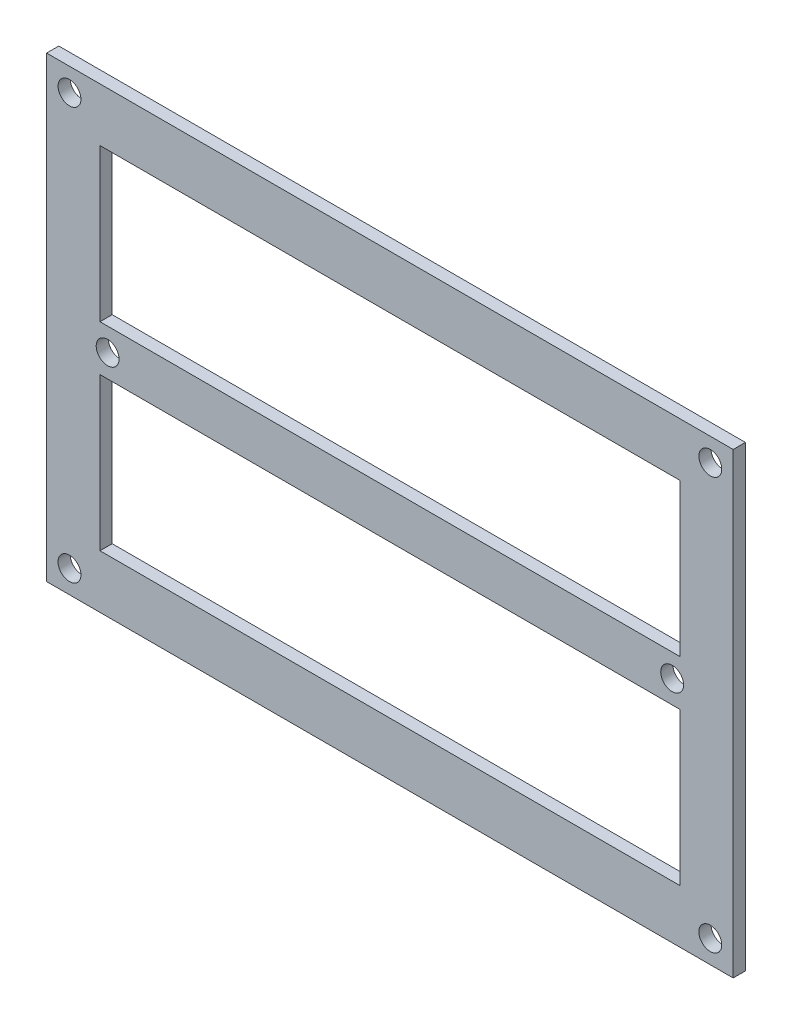
ISO-10303-21;
HEADER;
FILE_DESCRIPTION(('STEP AP214'),'2;1');
FILE_NAME('part.step','',(''),(''),'','','');
FILE_SCHEMA(('AUTOMOTIVE_DESIGN { 1 0 10303 214 1 1 1 1 }'));
ENDSEC;
DATA;
#1=APPLICATION_CONTEXT('core data for automotive mechanical design processes');
#2=APPLICATION_PROTOCOL_DEFINITION('international standard','automotive_design',2000,#1);
#3=PRODUCT_CONTEXT('',#1,'mechanical');
#4=PRODUCT('Part','Part','',(#3));
#5=PRODUCT_RELATED_PRODUCT_CATEGORY('part','',(#4));
#6=PRODUCT_DEFINITION_FORMATION('','',#4);
#7=PRODUCT_DEFINITION_CONTEXT('part definition',#1,'design');
#8=PRODUCT_DEFINITION('design','',#6,#7);
#9=PRODUCT_DEFINITION_SHAPE('','',#8);
#10=(LENGTH_UNIT() NAMED_UNIT(*) SI_UNIT(.MILLI.,.METRE.));
#11=(NAMED_UNIT(*) PLANE_ANGLE_UNIT() SI_UNIT($,.RADIAN.));
#12=(NAMED_UNIT(*) SI_UNIT($,.STERADIAN.) SOLID_ANGLE_UNIT());
#13=UNCERTAINTY_MEASURE_WITH_UNIT(LENGTH_MEASURE(1.E-05),#10,'distance_accuracy_value','');
#14=(GEOMETRIC_REPRESENTATION_CONTEXT(3) GLOBAL_UNCERTAINTY_ASSIGNED_CONTEXT((#13)) GLOBAL_UNIT_ASSIGNED_CONTEXT((#10,
#11,#12)) REPRESENTATION_CONTEXT('',''));
#15=CARTESIAN_POINT('',(0.,0.,0.));
#16=DIRECTION('',(0.,0.,1.));
#17=DIRECTION('',(1.,0.,0.));
#18=AXIS2_PLACEMENT_3D('',#15,#16,#17);
#19=CARTESIAN_POINT('',(-55.1929824561404,27.3684210526316,1.6));
#20=DIRECTION('',(1.,0.,0.));
#21=DIRECTION('',(0.,1.,0.));
#22=AXIS2_PLACEMENT_3D('',#19,#20,#21);
#23=PLANE('',#22);
#24=DIRECTION('',(0.,-1.,0.));
#25=VECTOR('',#24,1.);
#26=CARTESIAN_POINT('',(-55.1929824561404,27.3684210526316,0.));
#27=LINE('',#26,#25);
#28=CARTESIAN_POINT('',(-55.1929824561404,27.3684210526316,0.));
#29=VERTEX_POINT('',#28);
#30=CARTESIAN_POINT('',(-55.1929824561403,-32.6315789473684,0.));
#31=VERTEX_POINT('',#30);
#32=EDGE_CURVE('E195',#29,#31,#27,.T.);
#33=ORIENTED_EDGE('',*,*,#32,.T.);
#34=DIRECTION('',(0.,0.,-1.));
#35=VECTOR('',#34,1.);
#36=CARTESIAN_POINT('',(-55.1929824561403,-32.6315789473684,1.6));
#37=LINE('',#36,#35);
#38=CARTESIAN_POINT('',(-55.1929824561403,-32.6315789473684,1.6));
#39=VERTEX_POINT('',#38);
#40=EDGE_CURVE('E11',#39,#31,#37,.T.);
#41=ORIENTED_EDGE('',*,*,#40,.F.);
#42=DIRECTION('',(0.,-1.,0.));
#43=VECTOR('',#42,1.);
#44=CARTESIAN_POINT('',(-55.1929824561404,27.3684210526316,1.6));
#45=LINE('',#44,#43);
#46=CARTESIAN_POINT('',(-55.1929824561404,27.3684210526316,1.6));
#47=VERTEX_POINT('',#46);
#48=EDGE_CURVE('E202',#47,#39,#45,.T.);
#49=ORIENTED_EDGE('',*,*,#48,.F.);
#50=DIRECTION('',(0.,0.,-1.));
#51=VECTOR('',#50,1.);
#52=CARTESIAN_POINT('',(-55.1929824561404,27.3684210526316,1.6));
#53=LINE('',#52,#51);
#54=EDGE_CURVE('E212',#47,#29,#53,.T.);
#55=ORIENTED_EDGE('',*,*,#54,.T.);
#56=EDGE_LOOP('',(#33,#41,#49,#55));
#57=FACE_BOUND('',#56,.T.);
#58=ADVANCED_FACE('F33',(#57),#23,.F.);
#59=CARTESIAN_POINT('',(-55.1929824561403,-32.6315789473684,1.6));
#60=DIRECTION('',(0.,1.,0.));
#61=DIRECTION('',(0.,0.,1.));
#62=AXIS2_PLACEMENT_3D('',#59,#60,#61);
#63=PLANE('',#62);
#64=DIRECTION('',(1.,0.,0.));
#65=VECTOR('',#64,1.);
#66=CARTESIAN_POINT('',(-55.1929824561403,-32.6315789473684,0.));
#67=LINE('',#66,#65);
#68=CARTESIAN_POINT('',(34.8070175438596,-32.6315789473684,0.));
#69=VERTEX_POINT('',#68);
#70=EDGE_CURVE('E215',#31,#69,#67,.T.);
#71=ORIENTED_EDGE('',*,*,#70,.T.);
#72=DIRECTION('',(0.,0.,-1.));
#73=VECTOR('',#72,1.);
#74=CARTESIAN_POINT('',(34.8070175438596,-32.6315789473684,1.6));
#75=LINE('',#74,#73);
#76=CARTESIAN_POINT('',(34.8070175438596,-32.6315789473684,1.6));
#77=VERTEX_POINT('',#76);
#78=EDGE_CURVE('E40',#77,#69,#75,.T.);
#79=ORIENTED_EDGE('',*,*,#78,.F.);
#80=DIRECTION('',(1.,0.,0.));
#81=VECTOR('',#80,1.);
#82=CARTESIAN_POINT('',(-55.1929824561403,-32.6315789473684,1.6));
#83=LINE('',#82,#81);
#84=EDGE_CURVE('E205',#39,#77,#83,.T.);
#85=ORIENTED_EDGE('',*,*,#84,.F.);
#86=ORIENTED_EDGE('',*,*,#40,.T.);
#87=EDGE_LOOP('',(#71,#79,#85,#86));
#88=FACE_BOUND('',#87,.T.);
#89=ADVANCED_FACE('F244',(#88),#63,.F.);
#90=CARTESIAN_POINT('',(34.8070175438596,27.3684210526316,1.6));
#91=DIRECTION('',(-1.,0.,0.));
#92=DIRECTION('',(0.,0.,1.));
#93=AXIS2_PLACEMENT_3D('',#90,#91,#92);
#94=PLANE('',#93);
#95=DIRECTION('',(0.,1.,0.));
#96=VECTOR('',#95,1.);
#97=CARTESIAN_POINT('',(34.8070175438596,27.3684210526316,0.));
#98=LINE('',#97,#96);
#99=CARTESIAN_POINT('',(34.8070175438596,27.3684210526316,0.));
#100=VERTEX_POINT('',#99);
#101=EDGE_CURVE('E217',#69,#100,#98,.T.);
#102=ORIENTED_EDGE('',*,*,#101,.T.);
#103=DIRECTION('',(0.,0.,-1.));
#104=VECTOR('',#103,1.);
#105=CARTESIAN_POINT('',(34.8070175438596,27.3684210526316,1.6));
#106=LINE('',#105,#104);
#107=CARTESIAN_POINT('',(34.8070175438596,27.3684210526316,1.6));
#108=VERTEX_POINT('',#107);
#109=EDGE_CURVE('E222',#108,#100,#106,.T.);
#110=ORIENTED_EDGE('',*,*,#109,.F.);
#111=DIRECTION('',(0.,1.,0.));
#112=VECTOR('',#111,1.);
#113=CARTESIAN_POINT('',(34.8070175438596,27.3684210526316,1.6));
#114=LINE('',#113,#112);
#115=EDGE_CURVE('E208',#77,#108,#114,.T.);
#116=ORIENTED_EDGE('',*,*,#115,.F.);
#117=ORIENTED_EDGE('',*,*,#78,.T.);
#118=EDGE_LOOP('',(#102,#110,#116,#117));
#119=FACE_BOUND('',#118,.T.);
#120=ADVANCED_FACE('F229',(#119),#94,.F.);
#121=CARTESIAN_POINT('',(-55.1929824561404,27.3684210526316,1.6));
#122=DIRECTION('',(0.,-1.,0.));
#123=DIRECTION('',(0.,0.,-1.));
#124=AXIS2_PLACEMENT_3D('',#121,#122,#123);
#125=PLANE('',#124);
#126=DIRECTION('',(-1.,0.,0.));
#127=VECTOR('',#126,1.);
#128=CARTESIAN_POINT('',(-55.1929824561404,27.3684210526316,0.));
#129=LINE('',#128,#127);
#130=EDGE_CURVE('E206',#100,#29,#129,.T.);
#131=ORIENTED_EDGE('',*,*,#130,.T.);
#132=ORIENTED_EDGE('',*,*,#54,.F.);
#133=DIRECTION('',(-1.,0.,0.));
#134=VECTOR('',#133,1.);
#135=CARTESIAN_POINT('',(-55.1929824561404,27.3684210526316,1.6));
#136=LINE('',#135,#134);
#137=EDGE_CURVE('E210',#108,#47,#136,.T.);
#138=ORIENTED_EDGE('',*,*,#137,.F.);
#139=ORIENTED_EDGE('',*,*,#109,.T.);
#140=EDGE_LOOP('',(#131,#132,#138,#139));
#141=FACE_BOUND('',#140,.T.);
#142=ADVANCED_FACE('F238',(#141),#125,.F.);
#143=CARTESIAN_POINT('',(0.,0.,1.6));
#144=DIRECTION('',(0.,0.,1.));
#145=DIRECTION('',(1.,0.,0.));
#146=AXIS2_PLACEMENT_3D('',#143,#144,#145);
#147=PLANE('',#146);
#148=CARTESIAN_POINT('',(-52.1929824561404,24.3684210526316,1.6));
#149=DIRECTION('',(0.,0.,-1.));
#150=DIRECTION('',(-1.,0.,0.));
#151=AXIS2_PLACEMENT_3D('',#148,#149,#150);
#152=CIRCLE('',#151,1.5);
#153=CARTESIAN_POINT('',(-53.6929824561404,24.3684210526316,1.6));
#154=VERTEX_POINT('',#153);
#155=EDGE_CURVE('E338',#154,#154,#152,.T.);
#156=ORIENTED_EDGE('',*,*,#155,.T.);
#157=EDGE_LOOP('',(#156));
#158=FACE_BOUND('',#157,.T.);
#159=CARTESIAN_POINT('',(26.8070175438596,-2.63157894736842,1.6));
#160=DIRECTION('',(0.,0.,-1.));
#161=DIRECTION('',(-1.,0.,0.));
#162=AXIS2_PLACEMENT_3D('',#159,#160,#161);
#163=CIRCLE('',#162,1.5);
#164=CARTESIAN_POINT('',(25.3070175438596,-2.63157894736842,1.6));
#165=VERTEX_POINT('',#164);
#166=EDGE_CURVE('E171',#165,#165,#163,.T.);
#167=ORIENTED_EDGE('',*,*,#166,.T.);
#168=EDGE_LOOP('',(#167));
#169=FACE_BOUND('',#168,.T.);
#170=CARTESIAN_POINT('',(-47.1929824561404,-2.63157894736842,1.6));
#171=DIRECTION('',(0.,0.,-1.));
#172=DIRECTION('',(-1.,0.,0.));
#173=AXIS2_PLACEMENT_3D('',#170,#171,#172);
#174=CIRCLE('',#173,1.5);
#175=CARTESIAN_POINT('',(-48.6929824561404,-2.63157894736842,1.6));
#176=VERTEX_POINT('',#175);
#177=EDGE_CURVE('E156',#176,#176,#174,.T.);
#178=ORIENTED_EDGE('',*,*,#177,.T.);
#179=EDGE_LOOP('',(#178));
#180=FACE_BOUND('',#179,.T.);
#181=DIRECTION('',(0.,-1.,0.));
#182=VECTOR('',#181,1.);
#183=CARTESIAN_POINT('',(27.8070175438596,-5.63157894736842,1.6));
#184=LINE('',#183,#182);
#185=CARTESIAN_POINT('',(27.8070175438596,-5.63157894736842,1.6));
#186=VERTEX_POINT('',#185);
#187=CARTESIAN_POINT('',(27.8070175438596,-25.6315789473684,1.6));
#188=VERTEX_POINT('',#187);
#189=EDGE_CURVE('E125',#186,#188,#184,.T.);
#190=ORIENTED_EDGE('',*,*,#189,.T.);
#191=DIRECTION('',(-1.,0.,0.));
#192=VECTOR('',#191,1.);
#193=CARTESIAN_POINT('',(27.8070175438596,-25.6315789473684,1.6));
#194=LINE('',#193,#192);
#195=CARTESIAN_POINT('',(-48.1929824561404,-25.6315789473684,1.6));
#196=VERTEX_POINT('',#195);
#197=EDGE_CURVE('E136',#188,#196,#194,.T.);
#198=ORIENTED_EDGE('',*,*,#197,.T.);
#199=DIRECTION('',(0.,1.,0.));
#200=VECTOR('',#199,1.);
#201=CARTESIAN_POINT('',(-48.1929824561404,-5.63157894736842,1.6));
#202=LINE('',#201,#200);
#203=CARTESIAN_POINT('',(-48.1929824561404,-5.63157894736842,1.6));
#204=VERTEX_POINT('',#203);
#205=EDGE_CURVE('E47',#196,#204,#202,.T.);
#206=ORIENTED_EDGE('',*,*,#205,.T.);
#207=DIRECTION('',(1.,0.,0.));
#208=VECTOR('',#207,1.);
#209=CARTESIAN_POINT('',(27.8070175438596,-5.63157894736842,1.6));
#210=LINE('',#209,#208);
#211=EDGE_CURVE('E133',#204,#186,#210,.T.);
#212=ORIENTED_EDGE('',*,*,#211,.T.);
#213=EDGE_LOOP('',(#190,#198,#206,#212));
#214=FACE_BOUND('',#213,.T.);
#215=CARTESIAN_POINT('',(31.8070175438591,-29.631578947369,1.6));
#216=DIRECTION('',(0.,0.,-1.));
#217=DIRECTION('',(-1.,0.,0.));
#218=AXIS2_PLACEMENT_3D('',#215,#216,#217);
#219=CIRCLE('',#218,1.5);
#220=CARTESIAN_POINT('',(30.3070175438591,-29.631578947369,1.6));
#221=VERTEX_POINT('',#220);
#222=EDGE_CURVE('E314',#221,#221,#219,.T.);
#223=ORIENTED_EDGE('',*,*,#222,.T.);
#224=EDGE_LOOP('',(#223));
#225=FACE_BOUND('',#224,.T.);
#226=CARTESIAN_POINT('',(-52.1929824561409,-29.6315789473684,1.6));
#227=DIRECTION('',(0.,0.,-1.));
#228=DIRECTION('',(-1.,0.,0.));
#229=AXIS2_PLACEMENT_3D('',#226,#227,#228);
#230=CIRCLE('',#229,1.5);
#231=CARTESIAN_POINT('',(-53.6929824561409,-29.6315789473684,1.6));
#232=VERTEX_POINT('',#231);
#233=EDGE_CURVE('E329',#232,#232,#230,.T.);
#234=ORIENTED_EDGE('',*,*,#233,.T.);
#235=EDGE_LOOP('',(#234));
#236=FACE_BOUND('',#235,.T.);
#237=CARTESIAN_POINT('',(31.8070175438597,24.368421052631,1.6));
#238=DIRECTION('',(0.,0.,-1.));
#239=DIRECTION('',(-1.,0.,0.));
#240=AXIS2_PLACEMENT_3D('',#237,#238,#239);
#241=CIRCLE('',#240,1.5);
#242=CARTESIAN_POINT('',(30.3070175438596,24.368421052631,1.6));
#243=VERTEX_POINT('',#242);
#244=EDGE_CURVE('E323',#243,#243,#241,.T.);
#245=ORIENTED_EDGE('',*,*,#244,.T.);
#246=EDGE_LOOP('',(#245));
#247=FACE_BOUND('',#246,.T.);
#248=DIRECTION('',(0.,-1.,0.));
#249=VECTOR('',#248,1.);
#250=CARTESIAN_POINT('',(27.8070175438596,20.3684210526316,1.6));
#251=LINE('',#250,#249);
#252=CARTESIAN_POINT('',(27.8070175438596,20.3684210526316,1.6));
#253=VERTEX_POINT('',#252);
#254=CARTESIAN_POINT('',(27.8070175438596,0.368421052631577,1.6));
#255=VERTEX_POINT('',#254);
#256=EDGE_CURVE('E172',#253,#255,#251,.T.);
#257=ORIENTED_EDGE('',*,*,#256,.T.);
#258=DIRECTION('',(-1.,0.,0.));
#259=VECTOR('',#258,1.);
#260=CARTESIAN_POINT('',(27.8070175438596,0.368421052631577,1.6));
#261=LINE('',#260,#259);
#262=CARTESIAN_POINT('',(-48.1929824561404,0.368421052631577,1.6));
#263=VERTEX_POINT('',#262);
#264=EDGE_CURVE('E175',#255,#263,#261,.T.);
#265=ORIENTED_EDGE('',*,*,#264,.T.);
#266=DIRECTION('',(0.,1.,0.));
#267=VECTOR('',#266,1.);
#268=CARTESIAN_POINT('',(-48.1929824561403,20.3684210526316,1.6));
#269=LINE('',#268,#267);
#270=CARTESIAN_POINT('',(-48.1929824561403,20.3684210526316,1.6));
#271=VERTEX_POINT('',#270);
#272=EDGE_CURVE('E55',#263,#271,#269,.T.);
#273=ORIENTED_EDGE('',*,*,#272,.T.);
#274=DIRECTION('',(1.,0.,0.));
#275=VECTOR('',#274,1.);
#276=CARTESIAN_POINT('',(27.8070175438596,20.3684210526316,1.6));
#277=LINE('',#276,#275);
#278=EDGE_CURVE('E180',#271,#253,#277,.T.);
#279=ORIENTED_EDGE('',*,*,#278,.T.);
#280=EDGE_LOOP('',(#257,#265,#273,#279));
#281=FACE_BOUND('',#280,.T.);
#282=ORIENTED_EDGE('',*,*,#48,.T.);
#283=ORIENTED_EDGE('',*,*,#84,.T.);
#284=ORIENTED_EDGE('',*,*,#115,.T.);
#285=ORIENTED_EDGE('',*,*,#137,.T.);
#286=EDGE_LOOP('',(#282,#283,#284,#285));
#287=FACE_BOUND('',#286,.T.);
#288=ADVANCED_FACE('F140',(#158,#169,#180,#214,#225,#236,#247,#281,#287),#147,.T.);
#289=CARTESIAN_POINT('',(0.,0.,0.));
#290=DIRECTION('',(0.,0.,1.));
#291=DIRECTION('',(1.,0.,0.));
#292=AXIS2_PLACEMENT_3D('',#289,#290,#291);
#293=PLANE('',#292);
#294=CARTESIAN_POINT('',(-52.1929824561404,24.3684210526316,0.));
#295=DIRECTION('',(0.,0.,-1.));
#296=DIRECTION('',(-1.,0.,0.));
#297=AXIS2_PLACEMENT_3D('',#294,#295,#296);
#298=CIRCLE('',#297,1.5);
#299=CARTESIAN_POINT('',(-53.6929824561404,24.3684210526316,0.));
#300=VERTEX_POINT('',#299);
#301=EDGE_CURVE('E149',#300,#300,#298,.T.);
#302=ORIENTED_EDGE('',*,*,#301,.F.);
#303=EDGE_LOOP('',(#302));
#304=FACE_BOUND('',#303,.T.);
#305=CARTESIAN_POINT('',(26.8070175438596,-2.63157894736842,0.));
#306=DIRECTION('',(0.,0.,-1.));
#307=DIRECTION('',(-1.,0.,0.));
#308=AXIS2_PLACEMENT_3D('',#305,#306,#307);
#309=CIRCLE('',#308,1.5);
#310=CARTESIAN_POINT('',(25.3070175438596,-2.63157894736842,0.));
#311=VERTEX_POINT('',#310);
#312=EDGE_CURVE('E336',#311,#311,#309,.T.);
#313=ORIENTED_EDGE('',*,*,#312,.F.);
#314=EDGE_LOOP('',(#313));
#315=FACE_BOUND('',#314,.T.);
#316=CARTESIAN_POINT('',(-47.1929824561404,-2.63157894736842,0.));
#317=DIRECTION('',(0.,0.,-1.));
#318=DIRECTION('',(-1.,0.,0.));
#319=AXIS2_PLACEMENT_3D('',#316,#317,#318);
#320=CIRCLE('',#319,1.5);
#321=CARTESIAN_POINT('',(-48.6929824561404,-2.63157894736842,0.));
#322=VERTEX_POINT('',#321);
#323=EDGE_CURVE('E168',#322,#322,#320,.T.);
#324=ORIENTED_EDGE('',*,*,#323,.F.);
#325=EDGE_LOOP('',(#324));
#326=FACE_BOUND('',#325,.T.);
#327=DIRECTION('',(-1.,0.,0.));
#328=VECTOR('',#327,1.);
#329=CARTESIAN_POINT('',(27.8070175438596,-25.6315789473684,0.));
#330=LINE('',#329,#328);
#331=CARTESIAN_POINT('',(27.8070175438596,-25.6315789473684,0.));
#332=VERTEX_POINT('',#331);
#333=CARTESIAN_POINT('',(-48.1929824561404,-25.6315789473684,0.));
#334=VERTEX_POINT('',#333);
#335=EDGE_CURVE('E155',#332,#334,#330,.T.);
#336=ORIENTED_EDGE('',*,*,#335,.F.);
#337=DIRECTION('',(0.,-1.,0.));
#338=VECTOR('',#337,1.);
#339=CARTESIAN_POINT('',(27.8070175438596,-5.63157894736842,0.));
#340=LINE('',#339,#338);
#341=CARTESIAN_POINT('',(27.8070175438596,-5.63157894736842,0.));
#342=VERTEX_POINT('',#341);
#343=EDGE_CURVE('E128',#342,#332,#340,.T.);
#344=ORIENTED_EDGE('',*,*,#343,.F.);
#345=DIRECTION('',(1.,0.,0.));
#346=VECTOR('',#345,1.);
#347=CARTESIAN_POINT('',(27.8070175438596,-5.63157894736842,0.));
#348=LINE('',#347,#346);
#349=CARTESIAN_POINT('',(-48.1929824561404,-5.63157894736842,0.));
#350=VERTEX_POINT('',#349);
#351=EDGE_CURVE('E143',#350,#342,#348,.T.);
#352=ORIENTED_EDGE('',*,*,#351,.F.);
#353=DIRECTION('',(0.,1.,0.));
#354=VECTOR('',#353,1.);
#355=CARTESIAN_POINT('',(-48.1929824561404,-5.63157894736842,0.));
#356=LINE('',#355,#354);
#357=EDGE_CURVE('E146',#334,#350,#356,.T.);
#358=ORIENTED_EDGE('',*,*,#357,.F.);
#359=EDGE_LOOP('',(#336,#344,#352,#358));
#360=FACE_BOUND('',#359,.T.);
#361=CARTESIAN_POINT('',(31.8070175438591,-29.631578947369,0.));
#362=DIRECTION('',(0.,0.,-1.));
#363=DIRECTION('',(-1.,0.,0.));
#364=AXIS2_PLACEMENT_3D('',#361,#362,#363);
#365=CIRCLE('',#364,1.5);
#366=CARTESIAN_POINT('',(30.3070175438591,-29.631578947369,0.));
#367=VERTEX_POINT('',#366);
#368=EDGE_CURVE('E317',#367,#367,#365,.T.);
#369=ORIENTED_EDGE('',*,*,#368,.F.);
#370=EDGE_LOOP('',(#369));
#371=FACE_BOUND('',#370,.T.);
#372=CARTESIAN_POINT('',(-52.1929824561409,-29.6315789473684,0.));
#373=DIRECTION('',(0.,0.,-1.));
#374=DIRECTION('',(-1.,0.,0.));
#375=AXIS2_PLACEMENT_3D('',#372,#373,#374);
#376=CIRCLE('',#375,1.5);
#377=CARTESIAN_POINT('',(-53.6929824561409,-29.6315789473684,0.));
#378=VERTEX_POINT('',#377);
#379=EDGE_CURVE('E320',#378,#378,#376,.T.);
#380=ORIENTED_EDGE('',*,*,#379,.F.);
#381=EDGE_LOOP('',(#380));
#382=FACE_BOUND('',#381,.T.);
#383=CARTESIAN_POINT('',(31.8070175438597,24.368421052631,0.));
#384=DIRECTION('',(0.,0.,-1.));
#385=DIRECTION('',(-1.,0.,0.));
#386=AXIS2_PLACEMENT_3D('',#383,#384,#385);
#387=CIRCLE('',#386,1.5);
#388=CARTESIAN_POINT('',(30.3070175438596,24.368421052631,0.));
#389=VERTEX_POINT('',#388);
#390=EDGE_CURVE('E326',#389,#389,#387,.T.);
#391=ORIENTED_EDGE('',*,*,#390,.F.);
#392=EDGE_LOOP('',(#391));
#393=FACE_BOUND('',#392,.T.);
#394=DIRECTION('',(-1.,0.,0.));
#395=VECTOR('',#394,1.);
#396=CARTESIAN_POINT('',(27.8070175438596,0.368421052631577,0.));
#397=LINE('',#396,#395);
#398=CARTESIAN_POINT('',(27.8070175438596,0.368421052631577,0.));
#399=VERTEX_POINT('',#398);
#400=CARTESIAN_POINT('',(-48.1929824561404,0.368421052631577,0.));
#401=VERTEX_POINT('',#400);
#402=EDGE_CURVE('E185',#399,#401,#397,.T.);
#403=ORIENTED_EDGE('',*,*,#402,.F.);
#404=DIRECTION('',(0.,-1.,0.));
#405=VECTOR('',#404,1.);
#406=CARTESIAN_POINT('',(27.8070175438596,20.3684210526316,0.));
#407=LINE('',#406,#405);
#408=CARTESIAN_POINT('',(27.8070175438596,20.3684210526316,0.));
#409=VERTEX_POINT('',#408);
#410=EDGE_CURVE('E162',#409,#399,#407,.T.);
#411=ORIENTED_EDGE('',*,*,#410,.F.);
#412=DIRECTION('',(1.,0.,0.));
#413=VECTOR('',#412,1.);
#414=CARTESIAN_POINT('',(27.8070175438596,20.3684210526316,0.));
#415=LINE('',#414,#413);
#416=CARTESIAN_POINT('',(-48.1929824561403,20.3684210526316,0.));
#417=VERTEX_POINT('',#416);
#418=EDGE_CURVE('E176',#417,#409,#415,.T.);
#419=ORIENTED_EDGE('',*,*,#418,.F.);
#420=DIRECTION('',(0.,1.,0.));
#421=VECTOR('',#420,1.);
#422=CARTESIAN_POINT('',(-48.1929824561403,20.3684210526316,0.));
#423=LINE('',#422,#421);
#424=EDGE_CURVE('E188',#401,#417,#423,.T.);
#425=ORIENTED_EDGE('',*,*,#424,.F.);
#426=EDGE_LOOP('',(#403,#411,#419,#425));
#427=FACE_BOUND('',#426,.T.);
#428=ORIENTED_EDGE('',*,*,#32,.F.);
#429=ORIENTED_EDGE('',*,*,#130,.F.);
#430=ORIENTED_EDGE('',*,*,#101,.F.);
#431=ORIENTED_EDGE('',*,*,#70,.F.);
#432=EDGE_LOOP('',(#428,#429,#430,#431));
#433=FACE_BOUND('',#432,.T.);
#434=ADVANCED_FACE('F235',(#304,#315,#326,#360,#371,#382,#393,#427,#433),#293,.F.);
#435=CARTESIAN_POINT('',(27.8070175438596,20.3684210526316,1.6));
#436=DIRECTION('',(1.,0.,0.));
#437=DIRECTION('',(0.,1.,0.));
#438=AXIS2_PLACEMENT_3D('',#435,#436,#437);
#439=PLANE('',#438);
#440=ORIENTED_EDGE('',*,*,#410,.T.);
#441=DIRECTION('',(0.,0.,-1.));
#442=VECTOR('',#441,1.);
#443=CARTESIAN_POINT('',(27.8070175438596,0.368421052631577,1.6));
#444=LINE('',#443,#442);
#445=EDGE_CURVE('E183',#255,#399,#444,.T.);
#446=ORIENTED_EDGE('',*,*,#445,.F.);
#447=ORIENTED_EDGE('',*,*,#256,.F.);
#448=DIRECTION('',(0.,0.,-1.));
#449=VECTOR('',#448,1.);
#450=CARTESIAN_POINT('',(27.8070175438596,20.3684210526316,1.6));
#451=LINE('',#450,#449);
#452=EDGE_CURVE('E193',#253,#409,#451,.T.);
#453=ORIENTED_EDGE('',*,*,#452,.T.);
#454=EDGE_LOOP('',(#440,#446,#447,#453));
#455=FACE_BOUND('',#454,.T.);
#456=ADVANCED_FACE('F256',(#455),#439,.F.);
#457=CARTESIAN_POINT('',(27.8070175438596,20.3684210526316,1.6));
#458=DIRECTION('',(0.,1.,0.));
#459=DIRECTION('',(0.,0.,1.));
#460=AXIS2_PLACEMENT_3D('',#457,#458,#459);
#461=PLANE('',#460);
#462=ORIENTED_EDGE('',*,*,#418,.T.);
#463=ORIENTED_EDGE('',*,*,#452,.F.);
#464=ORIENTED_EDGE('',*,*,#278,.F.);
#465=DIRECTION('',(0.,0.,-1.));
#466=VECTOR('',#465,1.);
#467=CARTESIAN_POINT('',(-48.1929824561403,20.3684210526316,1.6));
#468=LINE('',#467,#466);
#469=EDGE_CURVE('E196',#271,#417,#468,.T.);
#470=ORIENTED_EDGE('',*,*,#469,.T.);
#471=EDGE_LOOP('',(#462,#463,#464,#470));
#472=FACE_BOUND('',#471,.T.);
#473=ADVANCED_FACE('F263',(#472),#461,.F.);
#474=CARTESIAN_POINT('',(-48.1929824561403,20.3684210526316,1.6));
#475=DIRECTION('',(-1.,0.,0.));
#476=DIRECTION('',(0.,-1.,0.));
#477=AXIS2_PLACEMENT_3D('',#474,#475,#476);
#478=PLANE('',#477);
#479=ORIENTED_EDGE('',*,*,#424,.T.);
#480=ORIENTED_EDGE('',*,*,#469,.F.);
#481=ORIENTED_EDGE('',*,*,#272,.F.);
#482=DIRECTION('',(0.,0.,-1.));
#483=VECTOR('',#482,1.);
#484=CARTESIAN_POINT('',(-48.1929824561404,0.368421052631577,1.6));
#485=LINE('',#484,#483);
#486=EDGE_CURVE('E198',#263,#401,#485,.T.);
#487=ORIENTED_EDGE('',*,*,#486,.T.);
#488=EDGE_LOOP('',(#479,#480,#481,#487));
#489=FACE_BOUND('',#488,.T.);
#490=ADVANCED_FACE('F269',(#489),#478,.F.);
#491=CARTESIAN_POINT('',(27.8070175438596,0.368421052631577,1.6));
#492=DIRECTION('',(0.,-1.,0.));
#493=DIRECTION('',(0.,0.,-1.));
#494=AXIS2_PLACEMENT_3D('',#491,#492,#493);
#495=PLANE('',#494);
#496=ORIENTED_EDGE('',*,*,#402,.T.);
#497=ORIENTED_EDGE('',*,*,#486,.F.);
#498=ORIENTED_EDGE('',*,*,#264,.F.);
#499=ORIENTED_EDGE('',*,*,#445,.T.);
#500=EDGE_LOOP('',(#496,#497,#498,#499));
#501=FACE_BOUND('',#500,.T.);
#502=ADVANCED_FACE('F265',(#501),#495,.F.);
#503=CARTESIAN_POINT('',(31.8070175438597,24.368421052631,1.6));
#504=DIRECTION('',(0.,0.,-1.));
#505=DIRECTION('',(-1.,0.,0.));
#506=AXIS2_PLACEMENT_3D('',#503,#504,#505);
#507=CYLINDRICAL_SURFACE('',#506,1.5);
#508=ORIENTED_EDGE('',*,*,#244,.F.);
#509=EDGE_LOOP('',(#508));
#510=FACE_BOUND('',#509,.T.);
#511=ORIENTED_EDGE('',*,*,#390,.T.);
#512=EDGE_LOOP('',(#511));
#513=FACE_BOUND('',#512,.T.);
#514=ADVANCED_FACE('F268',(#510,#513),#507,.F.);
#515=CARTESIAN_POINT('',(-52.1929824561409,-29.6315789473684,1.6));
#516=DIRECTION('',(0.,0.,-1.));
#517=DIRECTION('',(-1.,0.,0.));
#518=AXIS2_PLACEMENT_3D('',#515,#516,#517);
#519=CYLINDRICAL_SURFACE('',#518,1.5);
#520=ORIENTED_EDGE('',*,*,#233,.F.);
#521=EDGE_LOOP('',(#520));
#522=FACE_BOUND('',#521,.T.);
#523=ORIENTED_EDGE('',*,*,#379,.T.);
#524=EDGE_LOOP('',(#523));
#525=FACE_BOUND('',#524,.T.);
#526=ADVANCED_FACE('F300',(#522,#525),#519,.F.);
#527=CARTESIAN_POINT('',(31.8070175438591,-29.631578947369,1.6));
#528=DIRECTION('',(0.,0.,-1.));
#529=DIRECTION('',(-1.,0.,0.));
#530=AXIS2_PLACEMENT_3D('',#527,#528,#529);
#531=CYLINDRICAL_SURFACE('',#530,1.5);
#532=ORIENTED_EDGE('',*,*,#222,.F.);
#533=EDGE_LOOP('',(#532));
#534=FACE_BOUND('',#533,.T.);
#535=ORIENTED_EDGE('',*,*,#368,.T.);
#536=EDGE_LOOP('',(#535));
#537=FACE_BOUND('',#536,.T.);
#538=ADVANCED_FACE('F284',(#534,#537),#531,.F.);
#539=CARTESIAN_POINT('',(27.8070175438596,-5.63157894736842,1.6));
#540=DIRECTION('',(1.,0.,0.));
#541=DIRECTION('',(0.,1.,0.));
#542=AXIS2_PLACEMENT_3D('',#539,#540,#541);
#543=PLANE('',#542);
#544=ORIENTED_EDGE('',*,*,#343,.T.);
#545=DIRECTION('',(0.,0.,-1.));
#546=VECTOR('',#545,1.);
#547=CARTESIAN_POINT('',(27.8070175438596,-25.6315789473684,1.6));
#548=LINE('',#547,#546);
#549=EDGE_CURVE('E121',#188,#332,#548,.T.);
#550=ORIENTED_EDGE('',*,*,#549,.F.);
#551=ORIENTED_EDGE('',*,*,#189,.F.);
#552=DIRECTION('',(0.,0.,-1.));
#553=VECTOR('',#552,1.);
#554=CARTESIAN_POINT('',(27.8070175438596,-5.63157894736842,1.6));
#555=LINE('',#554,#553);
#556=EDGE_CURVE('E160',#186,#342,#555,.T.);
#557=ORIENTED_EDGE('',*,*,#556,.T.);
#558=EDGE_LOOP('',(#544,#550,#551,#557));
#559=FACE_BOUND('',#558,.T.);
#560=ADVANCED_FACE('F123',(#559),#543,.F.);
#561=CARTESIAN_POINT('',(27.8070175438596,-5.63157894736842,1.6));
#562=DIRECTION('',(0.,1.,0.));
#563=DIRECTION('',(0.,0.,1.));
#564=AXIS2_PLACEMENT_3D('',#561,#562,#563);
#565=PLANE('',#564);
#566=ORIENTED_EDGE('',*,*,#351,.T.);
#567=ORIENTED_EDGE('',*,*,#556,.F.);
#568=ORIENTED_EDGE('',*,*,#211,.F.);
#569=DIRECTION('',(0.,0.,-1.));
#570=VECTOR('',#569,1.);
#571=CARTESIAN_POINT('',(-48.1929824561404,-5.63157894736842,1.6));
#572=LINE('',#571,#570);
#573=EDGE_CURVE('E163',#204,#350,#572,.T.);
#574=ORIENTED_EDGE('',*,*,#573,.T.);
#575=EDGE_LOOP('',(#566,#567,#568,#574));
#576=FACE_BOUND('',#575,.T.);
#577=ADVANCED_FACE('F283',(#576),#565,.F.);
#578=CARTESIAN_POINT('',(-48.1929824561404,-5.63157894736842,1.6));
#579=DIRECTION('',(-1.,0.,0.));
#580=DIRECTION('',(0.,0.,1.));
#581=AXIS2_PLACEMENT_3D('',#578,#579,#580);
#582=PLANE('',#581);
#583=ORIENTED_EDGE('',*,*,#357,.T.);
#584=ORIENTED_EDGE('',*,*,#573,.F.);
#585=ORIENTED_EDGE('',*,*,#205,.F.);
#586=DIRECTION('',(0.,0.,-1.));
#587=VECTOR('',#586,1.);
#588=CARTESIAN_POINT('',(-48.1929824561404,-25.6315789473684,1.6));
#589=LINE('',#588,#587);
#590=EDGE_CURVE('E132',#196,#334,#589,.T.);
#591=ORIENTED_EDGE('',*,*,#590,.T.);
#592=EDGE_LOOP('',(#583,#584,#585,#591));
#593=FACE_BOUND('',#592,.T.);
#594=ADVANCED_FACE('F287',(#593),#582,.F.);
#595=CARTESIAN_POINT('',(27.8070175438596,-25.6315789473684,1.6));
#596=DIRECTION('',(0.,-1.,0.));
#597=DIRECTION('',(0.,0.,-1.));
#598=AXIS2_PLACEMENT_3D('',#595,#596,#597);
#599=PLANE('',#598);
#600=ORIENTED_EDGE('',*,*,#335,.T.);
#601=ORIENTED_EDGE('',*,*,#590,.F.);
#602=ORIENTED_EDGE('',*,*,#197,.F.);
#603=ORIENTED_EDGE('',*,*,#549,.T.);
#604=EDGE_LOOP('',(#600,#601,#602,#603));
#605=FACE_BOUND('',#604,.T.);
#606=ADVANCED_FACE('F137',(#605),#599,.F.);
#607=CARTESIAN_POINT('',(-47.1929824561404,-2.63157894736842,1.6));
#608=DIRECTION('',(0.,0.,-1.));
#609=DIRECTION('',(-1.,0.,0.));
#610=AXIS2_PLACEMENT_3D('',#607,#608,#609);
#611=CYLINDRICAL_SURFACE('',#610,1.5);
#612=ORIENTED_EDGE('',*,*,#177,.F.);
#613=EDGE_LOOP('',(#612));
#614=FACE_BOUND('',#613,.T.);
#615=ORIENTED_EDGE('',*,*,#323,.T.);
#616=EDGE_LOOP('',(#615));
#617=FACE_BOUND('',#616,.T.);
#618=ADVANCED_FACE('F276',(#614,#617),#611,.F.);
#619=CARTESIAN_POINT('',(26.8070175438596,-2.63157894736842,1.6));
#620=DIRECTION('',(0.,0.,-1.));
#621=DIRECTION('',(-1.,0.,0.));
#622=AXIS2_PLACEMENT_3D('',#619,#620,#621);
#623=CYLINDRICAL_SURFACE('',#622,1.5);
#624=ORIENTED_EDGE('',*,*,#166,.F.);
#625=EDGE_LOOP('',(#624));
#626=FACE_BOUND('',#625,.T.);
#627=ORIENTED_EDGE('',*,*,#312,.T.);
#628=EDGE_LOOP('',(#627));
#629=FACE_BOUND('',#628,.T.);
#630=ADVANCED_FACE('F279',(#626,#629),#623,.F.);
#631=CARTESIAN_POINT('',(-52.1929824561404,24.3684210526316,1.6));
#632=DIRECTION('',(0.,0.,-1.));
#633=DIRECTION('',(-1.,0.,0.));
#634=AXIS2_PLACEMENT_3D('',#631,#632,#633);
#635=CYLINDRICAL_SURFACE('',#634,1.5);
#636=ORIENTED_EDGE('',*,*,#155,.F.);
#637=EDGE_LOOP('',(#636));
#638=FACE_BOUND('',#637,.T.);
#639=ORIENTED_EDGE('',*,*,#301,.T.);
#640=EDGE_LOOP('',(#639));
#641=FACE_BOUND('',#640,.T.);
#642=ADVANCED_FACE('F293',(#638,#641),#635,.F.);
#643=CLOSED_SHELL('',(#58,#89,#120,#142,#288,#434,#456,#473,#490,#502,#514,#526,#538,#560,#577,
#594,#606,#618,#630,#642));
#644=MANIFOLD_SOLID_BREP('B2',#643);
#645=ADVANCED_BREP_SHAPE_REPRESENTATION('',(#18,#644),#14);
#646=SHAPE_DEFINITION_REPRESENTATION(#9,#645);
ENDSEC;
END-ISO-10303-21;
